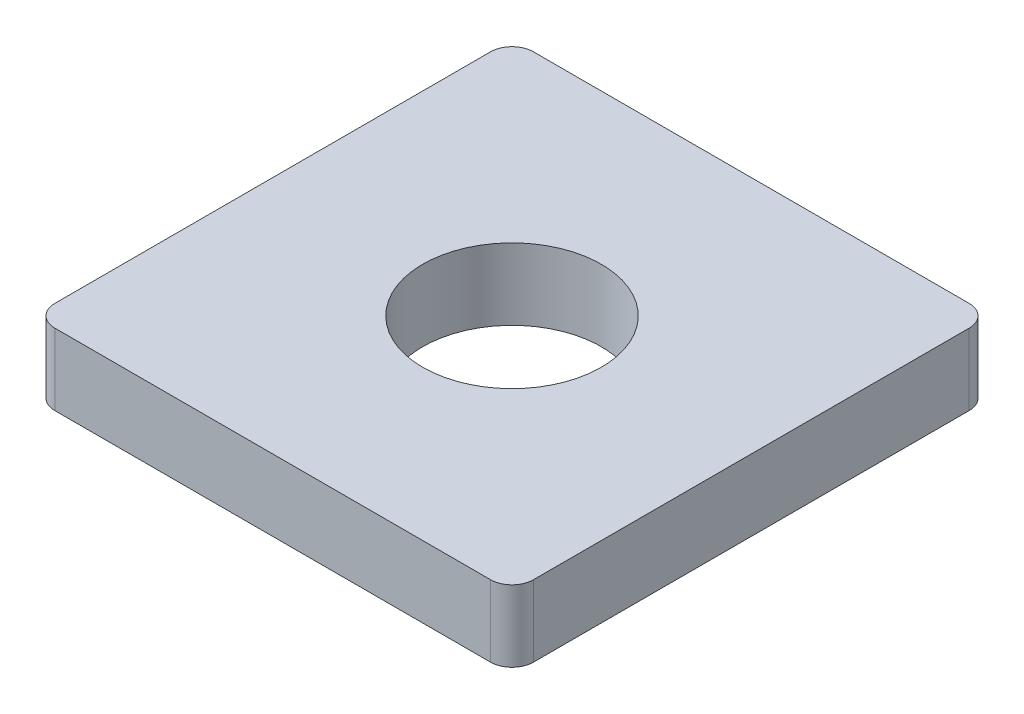
ISO-10303-21;
HEADER;
FILE_DESCRIPTION(('STEP AP214'),'2;1');
FILE_NAME('part.step','',(''),(''),'','','');
FILE_SCHEMA(('AUTOMOTIVE_DESIGN { 1 0 10303 214 1 1 1 1 }'));
ENDSEC;
DATA;
#1=APPLICATION_CONTEXT('core data for automotive mechanical design processes');
#2=APPLICATION_PROTOCOL_DEFINITION('international standard','automotive_design',2000,#1);
#3=PRODUCT_CONTEXT('',#1,'mechanical');
#4=PRODUCT('Part','Part','',(#3));
#5=PRODUCT_RELATED_PRODUCT_CATEGORY('part','',(#4));
#6=PRODUCT_DEFINITION_FORMATION('','',#4);
#7=PRODUCT_DEFINITION_CONTEXT('part definition',#1,'design');
#8=PRODUCT_DEFINITION('design','',#6,#7);
#9=PRODUCT_DEFINITION_SHAPE('','',#8);
#10=(LENGTH_UNIT() NAMED_UNIT(*) SI_UNIT(.MILLI.,.METRE.));
#11=(NAMED_UNIT(*) PLANE_ANGLE_UNIT() SI_UNIT($,.RADIAN.));
#12=(NAMED_UNIT(*) SI_UNIT($,.STERADIAN.) SOLID_ANGLE_UNIT());
#13=UNCERTAINTY_MEASURE_WITH_UNIT(LENGTH_MEASURE(1.E-05),#10,'distance_accuracy_value','');
#14=(GEOMETRIC_REPRESENTATION_CONTEXT(3) GLOBAL_UNCERTAINTY_ASSIGNED_CONTEXT((#13)) GLOBAL_UNIT_ASSIGNED_CONTEXT((#10,
#11,#12)) REPRESENTATION_CONTEXT('',''));
#15=CARTESIAN_POINT('',(0.,0.,0.));
#16=DIRECTION('',(0.,0.,1.));
#17=DIRECTION('',(1.,0.,0.));
#18=AXIS2_PLACEMENT_3D('',#15,#16,#17);
#19=CARTESIAN_POINT('',(3.35,1.,-3.35));
#20=DIRECTION('',(-1.,0.,0.));
#21=DIRECTION('',(0.,0.,1.));
#22=AXIS2_PLACEMENT_3D('',#19,#20,#21);
#23=PLANE('',#22);
#24=DIRECTION('',(0.,0.,-1.));
#25=VECTOR('',#24,1.);
#26=CARTESIAN_POINT('',(3.35,0.,-3.35));
#27=LINE('',#26,#25);
#28=CARTESIAN_POINT('',(3.35,0.,3.05));
#29=VERTEX_POINT('',#28);
#30=CARTESIAN_POINT('',(3.35,0.,-3.05));
#31=VERTEX_POINT('',#30);
#32=EDGE_CURVE('E129',#29,#31,#27,.T.);
#33=ORIENTED_EDGE('',*,*,#32,.T.);
#34=DIRECTION('',(0.,-1.,0.));
#35=VECTOR('',#34,1.);
#36=CARTESIAN_POINT('',(3.35,1.,-3.05));
#37=LINE('',#36,#35);
#38=CARTESIAN_POINT('',(3.35,1.,-3.05));
#39=VERTEX_POINT('',#38);
#40=EDGE_CURVE('E152',#31,#39,#37,.F.);
#41=ORIENTED_EDGE('',*,*,#40,.T.);
#42=DIRECTION('',(0.,0.,-1.));
#43=VECTOR('',#42,1.);
#44=CARTESIAN_POINT('',(3.35,1.,-3.35));
#45=LINE('',#44,#43);
#46=CARTESIAN_POINT('',(3.35,1.,3.05));
#47=VERTEX_POINT('',#46);
#48=EDGE_CURVE('E127',#47,#39,#45,.T.);
#49=ORIENTED_EDGE('',*,*,#48,.F.);
#50=DIRECTION('',(0.,-1.,0.));
#51=VECTOR('',#50,1.);
#52=CARTESIAN_POINT('',(3.35,1.,3.05));
#53=LINE('',#52,#51);
#54=EDGE_CURVE('E149',#47,#29,#53,.T.);
#55=ORIENTED_EDGE('',*,*,#54,.T.);
#56=EDGE_LOOP('',(#33,#41,#49,#55));
#57=FACE_BOUND('',#56,.T.);
#58=ADVANCED_FACE('F34',(#57),#23,.F.);
#59=CARTESIAN_POINT('',(-3.35,1.,-3.35));
#60=DIRECTION('',(0.,0.,1.));
#61=DIRECTION('',(1.,0.,0.));
#62=AXIS2_PLACEMENT_3D('',#59,#60,#61);
#63=PLANE('',#62);
#64=DIRECTION('',(-1.,0.,0.));
#65=VECTOR('',#64,1.);
#66=CARTESIAN_POINT('',(-3.35,0.,-3.35));
#67=LINE('',#66,#65);
#68=CARTESIAN_POINT('',(3.05,0.,-3.35));
#69=VERTEX_POINT('',#68);
#70=CARTESIAN_POINT('',(-3.05,0.,-3.35));
#71=VERTEX_POINT('',#70);
#72=EDGE_CURVE('E125',#69,#71,#67,.T.);
#73=ORIENTED_EDGE('',*,*,#72,.T.);
#74=DIRECTION('',(0.,-1.,0.));
#75=VECTOR('',#74,1.);
#76=CARTESIAN_POINT('',(-3.05,1.,-3.35));
#77=LINE('',#76,#75);
#78=CARTESIAN_POINT('',(-3.05,1.,-3.35));
#79=VERTEX_POINT('',#78);
#80=EDGE_CURVE('E104',#71,#79,#77,.F.);
#81=ORIENTED_EDGE('',*,*,#80,.T.);
#82=DIRECTION('',(-1.,0.,0.));
#83=VECTOR('',#82,1.);
#84=CARTESIAN_POINT('',(-3.35,1.,-3.35));
#85=LINE('',#84,#83);
#86=CARTESIAN_POINT('',(3.05,1.,-3.35));
#87=VERTEX_POINT('',#86);
#88=EDGE_CURVE('E168',#87,#79,#85,.T.);
#89=ORIENTED_EDGE('',*,*,#88,.F.);
#90=DIRECTION('',(0.,-1.,0.));
#91=VECTOR('',#90,1.);
#92=CARTESIAN_POINT('',(3.05,1.,-3.35));
#93=LINE('',#92,#91);
#94=EDGE_CURVE('E109',#87,#69,#93,.T.);
#95=ORIENTED_EDGE('',*,*,#94,.T.);
#96=EDGE_LOOP('',(#73,#81,#89,#95));
#97=FACE_BOUND('',#96,.T.);
#98=ADVANCED_FACE('F192',(#97),#63,.F.);
#99=CARTESIAN_POINT('',(-3.35,1.,-3.35));
#100=DIRECTION('',(1.,0.,0.));
#101=DIRECTION('',(0.,0.,-1.));
#102=AXIS2_PLACEMENT_3D('',#99,#100,#101);
#103=PLANE('',#102);
#104=DIRECTION('',(0.,0.,1.));
#105=VECTOR('',#104,1.);
#106=CARTESIAN_POINT('',(-3.35,1.,-3.35));
#107=LINE('',#106,#105);
#108=CARTESIAN_POINT('',(-3.35,1.,-3.05));
#109=VERTEX_POINT('',#108);
#110=CARTESIAN_POINT('',(-3.35,1.,3.05));
#111=VERTEX_POINT('',#110);
#112=EDGE_CURVE('E118',#109,#111,#107,.T.);
#113=ORIENTED_EDGE('',*,*,#112,.F.);
#114=DIRECTION('',(0.,-1.,0.));
#115=VECTOR('',#114,1.);
#116=CARTESIAN_POINT('',(-3.35,1.,-3.05));
#117=LINE('',#116,#115);
#118=CARTESIAN_POINT('',(-3.35,0.,-3.05));
#119=VERTEX_POINT('',#118);
#120=EDGE_CURVE('E103',#109,#119,#117,.T.);
#121=ORIENTED_EDGE('',*,*,#120,.T.);
#122=DIRECTION('',(0.,0.,1.));
#123=VECTOR('',#122,1.);
#124=CARTESIAN_POINT('',(-3.35,0.,-3.35));
#125=LINE('',#124,#123);
#126=CARTESIAN_POINT('',(-3.35,0.,3.05));
#127=VERTEX_POINT('',#126);
#128=EDGE_CURVE('E116',#119,#127,#125,.T.);
#129=ORIENTED_EDGE('',*,*,#128,.T.);
#130=DIRECTION('',(0.,-1.,0.));
#131=VECTOR('',#130,1.);
#132=CARTESIAN_POINT('',(-3.35,1.,3.05));
#133=LINE('',#132,#131);
#134=EDGE_CURVE('E120',#127,#111,#133,.F.);
#135=ORIENTED_EDGE('',*,*,#134,.T.);
#136=EDGE_LOOP('',(#113,#121,#129,#135));
#137=FACE_BOUND('',#136,.T.);
#138=ADVANCED_FACE('F115',(#137),#103,.F.);
#139=CARTESIAN_POINT('',(-3.35,1.,3.35));
#140=DIRECTION('',(0.,0.,-1.));
#141=DIRECTION('',(-1.,0.,0.));
#142=AXIS2_PLACEMENT_3D('',#139,#140,#141);
#143=PLANE('',#142);
#144=DIRECTION('',(1.,0.,0.));
#145=VECTOR('',#144,1.);
#146=CARTESIAN_POINT('',(-3.35,0.,3.35));
#147=LINE('',#146,#145);
#148=CARTESIAN_POINT('',(-3.05,0.,3.35));
#149=VERTEX_POINT('',#148);
#150=CARTESIAN_POINT('',(3.05,0.,3.35));
#151=VERTEX_POINT('',#150);
#152=EDGE_CURVE('E124',#149,#151,#147,.T.);
#153=ORIENTED_EDGE('',*,*,#152,.T.);
#154=DIRECTION('',(0.,-1.,0.));
#155=VECTOR('',#154,1.);
#156=CARTESIAN_POINT('',(3.05,1.,3.35));
#157=LINE('',#156,#155);
#158=CARTESIAN_POINT('',(3.05,1.,3.35));
#159=VERTEX_POINT('',#158);
#160=EDGE_CURVE('E11',#151,#159,#157,.F.);
#161=ORIENTED_EDGE('',*,*,#160,.T.);
#162=DIRECTION('',(1.,0.,0.));
#163=VECTOR('',#162,1.);
#164=CARTESIAN_POINT('',(-3.35,1.,3.35));
#165=LINE('',#164,#163);
#166=CARTESIAN_POINT('',(-3.05,1.,3.35));
#167=VERTEX_POINT('',#166);
#168=EDGE_CURVE('E133',#167,#159,#165,.T.);
#169=ORIENTED_EDGE('',*,*,#168,.F.);
#170=DIRECTION('',(0.,-1.,0.));
#171=VECTOR('',#170,1.);
#172=CARTESIAN_POINT('',(-3.05,1.,3.35));
#173=LINE('',#172,#171);
#174=EDGE_CURVE('E42',#167,#149,#173,.T.);
#175=ORIENTED_EDGE('',*,*,#174,.T.);
#176=EDGE_LOOP('',(#153,#161,#169,#175));
#177=FACE_BOUND('',#176,.T.);
#178=ADVANCED_FACE('F155',(#177),#143,.F.);
#179=CARTESIAN_POINT('',(0.,1.,0.));
#180=DIRECTION('',(0.,1.,0.));
#181=DIRECTION('',(0.,0.,1.));
#182=AXIS2_PLACEMENT_3D('',#179,#180,#181);
#183=PLANE('',#182);
#184=CARTESIAN_POINT('',(0.,1.,0.));
#185=DIRECTION('',(0.,1.,0.));
#186=DIRECTION('',(0.,0.,1.));
#187=AXIS2_PLACEMENT_3D('',#184,#185,#186);
#188=CIRCLE('',#187,1.24999999999999);
#189=CARTESIAN_POINT('',(0.,1.,1.24999999999999));
#190=VERTEX_POINT('',#189);
#191=EDGE_CURVE('E178',#190,#190,#188,.T.);
#192=ORIENTED_EDGE('',*,*,#191,.F.);
#193=EDGE_LOOP('',(#192));
#194=FACE_BOUND('',#193,.T.);
#195=ORIENTED_EDGE('',*,*,#88,.T.);
#196=CARTESIAN_POINT('',(-3.05,1.,-3.05));
#197=DIRECTION('',(0.,1.,0.));
#198=DIRECTION('',(0.,0.,1.));
#199=AXIS2_PLACEMENT_3D('',#196,#197,#198);
#200=CIRCLE('',#199,0.3);
#201=EDGE_CURVE('E147',#79,#109,#200,.T.);
#202=ORIENTED_EDGE('',*,*,#201,.T.);
#203=ORIENTED_EDGE('',*,*,#112,.T.);
#204=CARTESIAN_POINT('',(-3.05,1.,3.05));
#205=DIRECTION('',(0.,1.,0.));
#206=DIRECTION('',(0.,0.,1.));
#207=AXIS2_PLACEMENT_3D('',#204,#205,#206);
#208=CIRCLE('',#207,0.3);
#209=EDGE_CURVE('E54',#111,#167,#208,.T.);
#210=ORIENTED_EDGE('',*,*,#209,.T.);
#211=ORIENTED_EDGE('',*,*,#168,.T.);
#212=CARTESIAN_POINT('',(3.05,1.,3.05));
#213=DIRECTION('',(0.,1.,0.));
#214=DIRECTION('',(0.,0.,1.));
#215=AXIS2_PLACEMENT_3D('',#212,#213,#214);
#216=CIRCLE('',#215,0.3);
#217=EDGE_CURVE('E143',#159,#47,#216,.T.);
#218=ORIENTED_EDGE('',*,*,#217,.T.);
#219=ORIENTED_EDGE('',*,*,#48,.T.);
#220=CARTESIAN_POINT('',(3.05,1.,-3.05));
#221=DIRECTION('',(0.,1.,0.));
#222=DIRECTION('',(0.,0.,1.));
#223=AXIS2_PLACEMENT_3D('',#220,#221,#222);
#224=CIRCLE('',#223,0.3);
#225=EDGE_CURVE('E145',#39,#87,#224,.T.);
#226=ORIENTED_EDGE('',*,*,#225,.T.);
#227=EDGE_LOOP('',(#195,#202,#203,#210,#211,#218,#219,#226));
#228=FACE_BOUND('',#227,.T.);
#229=ADVANCED_FACE('F186',(#194,#228),#183,.T.);
#230=CARTESIAN_POINT('',(0.,0.,0.));
#231=DIRECTION('',(0.,1.,0.));
#232=DIRECTION('',(0.,0.,1.));
#233=AXIS2_PLACEMENT_3D('',#230,#231,#232);
#234=PLANE('',#233);
#235=CARTESIAN_POINT('',(0.,0.,0.));
#236=DIRECTION('',(0.,1.,0.));
#237=DIRECTION('',(0.,0.,1.));
#238=AXIS2_PLACEMENT_3D('',#235,#236,#237);
#239=CIRCLE('',#238,1.25);
#240=CARTESIAN_POINT('',(0.,0.,1.25));
#241=VERTEX_POINT('',#240);
#242=EDGE_CURVE('E173',#241,#241,#239,.T.);
#243=ORIENTED_EDGE('',*,*,#242,.T.);
#244=EDGE_LOOP('',(#243));
#245=FACE_BOUND('',#244,.T.);
#246=ORIENTED_EDGE('',*,*,#128,.F.);
#247=CARTESIAN_POINT('',(-3.05,0.,-3.05));
#248=DIRECTION('',(0.,1.,0.));
#249=DIRECTION('',(0.,0.,1.));
#250=AXIS2_PLACEMENT_3D('',#247,#248,#249);
#251=CIRCLE('',#250,0.3);
#252=EDGE_CURVE('E99',#119,#71,#251,.F.);
#253=ORIENTED_EDGE('',*,*,#252,.T.);
#254=ORIENTED_EDGE('',*,*,#72,.F.);
#255=CARTESIAN_POINT('',(3.05,0.,-3.05));
#256=DIRECTION('',(0.,1.,0.));
#257=DIRECTION('',(0.,0.,1.));
#258=AXIS2_PLACEMENT_3D('',#255,#256,#257);
#259=CIRCLE('',#258,0.3);
#260=EDGE_CURVE('E110',#69,#31,#259,.F.);
#261=ORIENTED_EDGE('',*,*,#260,.T.);
#262=ORIENTED_EDGE('',*,*,#32,.F.);
#263=CARTESIAN_POINT('',(3.05,0.,3.05));
#264=DIRECTION('',(0.,1.,0.));
#265=DIRECTION('',(0.,0.,1.));
#266=AXIS2_PLACEMENT_3D('',#263,#264,#265);
#267=CIRCLE('',#266,0.3);
#268=EDGE_CURVE('E136',#29,#151,#267,.F.);
#269=ORIENTED_EDGE('',*,*,#268,.T.);
#270=ORIENTED_EDGE('',*,*,#152,.F.);
#271=CARTESIAN_POINT('',(-3.05,0.,3.05));
#272=DIRECTION('',(0.,1.,0.));
#273=DIRECTION('',(0.,0.,1.));
#274=AXIS2_PLACEMENT_3D('',#271,#272,#273);
#275=CIRCLE('',#274,0.3);
#276=EDGE_CURVE('E119',#149,#127,#275,.F.);
#277=ORIENTED_EDGE('',*,*,#276,.T.);
#278=EDGE_LOOP('',(#246,#253,#254,#261,#262,#269,#270,#277));
#279=FACE_BOUND('',#278,.T.);
#280=ADVANCED_FACE('F122',(#245,#279),#234,.F.);
#281=CARTESIAN_POINT('',(0.,1.,0.));
#282=DIRECTION('',(0.,1.,0.));
#283=DIRECTION('',(0.,0.,1.));
#284=AXIS2_PLACEMENT_3D('',#281,#282,#283);
#285=CYLINDRICAL_SURFACE('',#284,1.24999999999999);
#286=ORIENTED_EDGE('',*,*,#242,.F.);
#287=EDGE_LOOP('',(#286));
#288=FACE_BOUND('',#287,.T.);
#289=ORIENTED_EDGE('',*,*,#191,.T.);
#290=EDGE_LOOP('',(#289));
#291=FACE_BOUND('',#290,.T.);
#292=ADVANCED_FACE('F184',(#288,#291),#285,.F.);
#293=CARTESIAN_POINT('',(-3.05,1.,-3.05));
#294=DIRECTION('',(0.,-1.,0.));
#295=DIRECTION('',(0.,0.,-1.));
#296=AXIS2_PLACEMENT_3D('',#293,#294,#295);
#297=CYLINDRICAL_SURFACE('',#296,0.3);
#298=ORIENTED_EDGE('',*,*,#201,.F.);
#299=ORIENTED_EDGE('',*,*,#80,.F.);
#300=ORIENTED_EDGE('',*,*,#252,.F.);
#301=ORIENTED_EDGE('',*,*,#120,.F.);
#302=EDGE_LOOP('',(#298,#299,#300,#301));
#303=FACE_BOUND('',#302,.T.);
#304=ADVANCED_FACE('F102',(#303),#297,.T.);
#305=CARTESIAN_POINT('',(3.05,1.,-3.05));
#306=DIRECTION('',(0.,-1.,0.));
#307=DIRECTION('',(0.,0.,-1.));
#308=AXIS2_PLACEMENT_3D('',#305,#306,#307);
#309=CYLINDRICAL_SURFACE('',#308,0.3);
#310=ORIENTED_EDGE('',*,*,#225,.F.);
#311=ORIENTED_EDGE('',*,*,#40,.F.);
#312=ORIENTED_EDGE('',*,*,#260,.F.);
#313=ORIENTED_EDGE('',*,*,#94,.F.);
#314=EDGE_LOOP('',(#310,#311,#312,#313));
#315=FACE_BOUND('',#314,.T.);
#316=ADVANCED_FACE('F194',(#315),#309,.T.);
#317=CARTESIAN_POINT('',(3.05,1.,3.05));
#318=DIRECTION('',(0.,-1.,0.));
#319=DIRECTION('',(0.,0.,-1.));
#320=AXIS2_PLACEMENT_3D('',#317,#318,#319);
#321=CYLINDRICAL_SURFACE('',#320,0.3);
#322=ORIENTED_EDGE('',*,*,#217,.F.);
#323=ORIENTED_EDGE('',*,*,#160,.F.);
#324=ORIENTED_EDGE('',*,*,#268,.F.);
#325=ORIENTED_EDGE('',*,*,#54,.F.);
#326=EDGE_LOOP('',(#322,#323,#324,#325));
#327=FACE_BOUND('',#326,.T.);
#328=ADVANCED_FACE('F162',(#327),#321,.T.);
#329=CARTESIAN_POINT('',(-3.05,1.,3.05));
#330=DIRECTION('',(0.,-1.,0.));
#331=DIRECTION('',(0.,0.,-1.));
#332=AXIS2_PLACEMENT_3D('',#329,#330,#331);
#333=CYLINDRICAL_SURFACE('',#332,0.3);
#334=ORIENTED_EDGE('',*,*,#209,.F.);
#335=ORIENTED_EDGE('',*,*,#134,.F.);
#336=ORIENTED_EDGE('',*,*,#276,.F.);
#337=ORIENTED_EDGE('',*,*,#174,.F.);
#338=EDGE_LOOP('',(#334,#335,#336,#337));
#339=FACE_BOUND('',#338,.T.);
#340=ADVANCED_FACE('F36',(#339),#333,.T.);
#341=CLOSED_SHELL('',(#58,#98,#138,#178,#229,#280,#292,#304,#316,#328,#340));
#342=MANIFOLD_SOLID_BREP('B2',#341);
#343=ADVANCED_BREP_SHAPE_REPRESENTATION('',(#18,#342),#14);
#344=SHAPE_DEFINITION_REPRESENTATION(#9,#343);
ENDSEC;
END-ISO-10303-21;
